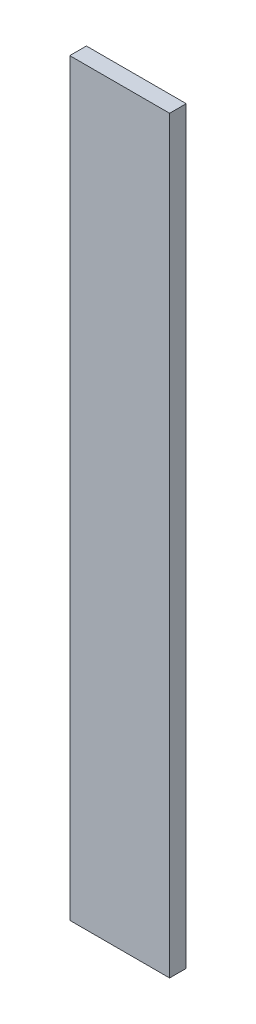
ISO-10303-21;
HEADER;
FILE_DESCRIPTION(('STEP AP214'),'2;1');
FILE_NAME('part.step','',(''),(''),'','','');
FILE_SCHEMA(('AUTOMOTIVE_DESIGN { 1 0 10303 214 1 1 1 1 }'));
ENDSEC;
DATA;
#1=APPLICATION_CONTEXT('core data for automotive mechanical design processes');
#2=APPLICATION_PROTOCOL_DEFINITION('international standard','automotive_design',2000,#1);
#3=PRODUCT_CONTEXT('',#1,'mechanical');
#4=PRODUCT('Part','Part','',(#3));
#5=PRODUCT_RELATED_PRODUCT_CATEGORY('part','',(#4));
#6=PRODUCT_DEFINITION_FORMATION('','',#4);
#7=PRODUCT_DEFINITION_CONTEXT('part definition',#1,'design');
#8=PRODUCT_DEFINITION('design','',#6,#7);
#9=PRODUCT_DEFINITION_SHAPE('','',#8);
#10=(LENGTH_UNIT() NAMED_UNIT(*) SI_UNIT(.MILLI.,.METRE.));
#11=(NAMED_UNIT(*) PLANE_ANGLE_UNIT() SI_UNIT($,.RADIAN.));
#12=(NAMED_UNIT(*) SI_UNIT($,.STERADIAN.) SOLID_ANGLE_UNIT());
#13=UNCERTAINTY_MEASURE_WITH_UNIT(LENGTH_MEASURE(1.E-05),#10,'distance_accuracy_value','');
#14=(GEOMETRIC_REPRESENTATION_CONTEXT(3) GLOBAL_UNCERTAINTY_ASSIGNED_CONTEXT((#13)) GLOBAL_UNIT_ASSIGNED_CONTEXT((#10,
#11,#12)) REPRESENTATION_CONTEXT('',''));
#15=CARTESIAN_POINT('',(0.,0.,0.));
#16=DIRECTION('',(0.,0.,1.));
#17=DIRECTION('',(1.,0.,0.));
#18=AXIS2_PLACEMENT_3D('',#15,#16,#17);
#19=CARTESIAN_POINT('',(-0.0762,0.5715,0.0254));
#20=DIRECTION('',(0.,0.,1.));
#21=DIRECTION('',(1.,0.,0.));
#22=AXIS2_PLACEMENT_3D('',#19,#20,#21);
#23=PLANE('',#22);
#24=DIRECTION('',(0.,1.,0.));
#25=VECTOR('',#24,1.);
#26=CARTESIAN_POINT('',(0.0762,0.5715,0.0254));
#27=LINE('',#26,#25);
#28=CARTESIAN_POINT('',(0.0762,0.5715,0.0254));
#29=VERTEX_POINT('',#28);
#30=CARTESIAN_POINT('',(0.0762,-0.5715,0.0254));
#31=VERTEX_POINT('',#30);
#32=EDGE_CURVE('E53',#29,#31,#27,.F.);
#33=ORIENTED_EDGE('',*,*,#32,.F.);
#34=DIRECTION('',(1.,0.,0.));
#35=VECTOR('',#34,1.);
#36=CARTESIAN_POINT('',(-0.0762,0.5715,0.0254));
#37=LINE('',#36,#35);
#38=CARTESIAN_POINT('',(-0.0762,0.5715,0.0254));
#39=VERTEX_POINT('',#38);
#40=EDGE_CURVE('E68',#39,#29,#37,.T.);
#41=ORIENTED_EDGE('',*,*,#40,.F.);
#42=DIRECTION('',(0.,1.,0.));
#43=VECTOR('',#42,1.);
#44=CARTESIAN_POINT('',(-0.0762,-0.5715,0.0254));
#45=LINE('',#44,#43);
#46=CARTESIAN_POINT('',(-0.0762,-0.5715,0.0254));
#47=VERTEX_POINT('',#46);
#48=EDGE_CURVE('E20',#47,#39,#45,.T.);
#49=ORIENTED_EDGE('',*,*,#48,.F.);
#50=DIRECTION('',(1.,0.,0.));
#51=VECTOR('',#50,1.);
#52=CARTESIAN_POINT('',(0.0762,-0.5715,0.0254));
#53=LINE('',#52,#51);
#54=EDGE_CURVE('E58',#31,#47,#53,.F.);
#55=ORIENTED_EDGE('',*,*,#54,.F.);
#56=EDGE_LOOP('',(#33,#41,#49,#55));
#57=FACE_BOUND('',#56,.T.);
#58=ADVANCED_FACE('F17',(#57),#23,.T.);
#59=CARTESIAN_POINT('',(-0.0762,-0.5715,0.));
#60=DIRECTION('',(-1.,0.,0.));
#61=DIRECTION('',(0.,0.,1.));
#62=AXIS2_PLACEMENT_3D('',#59,#60,#61);
#63=PLANE('',#62);
#64=DIRECTION('',(0.,0.,1.));
#65=VECTOR('',#64,1.);
#66=CARTESIAN_POINT('',(-0.0762,0.5715,0.));
#67=LINE('',#66,#65);
#68=CARTESIAN_POINT('',(-0.0762,0.5715,0.));
#69=VERTEX_POINT('',#68);
#70=EDGE_CURVE('E79',#69,#39,#67,.T.);
#71=ORIENTED_EDGE('',*,*,#70,.F.);
#72=DIRECTION('',(0.,1.,0.));
#73=VECTOR('',#72,1.);
#74=CARTESIAN_POINT('',(-0.0762,0.5715,0.));
#75=LINE('',#74,#73);
#76=CARTESIAN_POINT('',(-0.0762,-0.5715,0.));
#77=VERTEX_POINT('',#76);
#78=EDGE_CURVE('E74',#69,#77,#75,.F.);
#79=ORIENTED_EDGE('',*,*,#78,.T.);
#80=DIRECTION('',(0.,0.,-1.));
#81=VECTOR('',#80,1.);
#82=CARTESIAN_POINT('',(-0.0762,-0.5715,0.));
#83=LINE('',#82,#81);
#84=EDGE_CURVE('E63',#47,#77,#83,.T.);
#85=ORIENTED_EDGE('',*,*,#84,.F.);
#86=ORIENTED_EDGE('',*,*,#48,.T.);
#87=EDGE_LOOP('',(#71,#79,#85,#86));
#88=FACE_BOUND('',#87,.T.);
#89=ADVANCED_FACE('F73',(#88),#63,.T.);
#90=CARTESIAN_POINT('',(0.0762,-0.5715,0.));
#91=DIRECTION('',(0.,-1.,0.));
#92=DIRECTION('',(0.,0.,-1.));
#93=AXIS2_PLACEMENT_3D('',#90,#91,#92);
#94=PLANE('',#93);
#95=ORIENTED_EDGE('',*,*,#84,.T.);
#96=DIRECTION('',(1.,0.,0.));
#97=VECTOR('',#96,1.);
#98=CARTESIAN_POINT('',(-0.0762,-0.5715,0.));
#99=LINE('',#98,#97);
#100=CARTESIAN_POINT('',(0.0762,-0.5715,0.));
#101=VERTEX_POINT('',#100);
#102=EDGE_CURVE('E84',#77,#101,#99,.T.);
#103=ORIENTED_EDGE('',*,*,#102,.T.);
#104=DIRECTION('',(0.,0.,-1.));
#105=VECTOR('',#104,1.);
#106=CARTESIAN_POINT('',(0.0762,-0.5715,0.));
#107=LINE('',#106,#105);
#108=EDGE_CURVE('E65',#31,#101,#107,.T.);
#109=ORIENTED_EDGE('',*,*,#108,.F.);
#110=ORIENTED_EDGE('',*,*,#54,.T.);
#111=EDGE_LOOP('',(#95,#103,#109,#110));
#112=FACE_BOUND('',#111,.T.);
#113=ADVANCED_FACE('F60',(#112),#94,.T.);
#114=CARTESIAN_POINT('',(0.0762,0.5715,0.));
#115=DIRECTION('',(1.,0.,0.));
#116=DIRECTION('',(0.,0.,-1.));
#117=AXIS2_PLACEMENT_3D('',#114,#115,#116);
#118=PLANE('',#117);
#119=ORIENTED_EDGE('',*,*,#108,.T.);
#120=DIRECTION('',(0.,1.,0.));
#121=VECTOR('',#120,1.);
#122=CARTESIAN_POINT('',(0.0762,0.5715,0.));
#123=LINE('',#122,#121);
#124=CARTESIAN_POINT('',(0.0762,0.5715,0.));
#125=VERTEX_POINT('',#124);
#126=EDGE_CURVE('E26',#101,#125,#123,.T.);
#127=ORIENTED_EDGE('',*,*,#126,.T.);
#128=DIRECTION('',(0.,0.,1.));
#129=VECTOR('',#128,1.);
#130=CARTESIAN_POINT('',(0.0762,0.5715,0.));
#131=LINE('',#130,#129);
#132=EDGE_CURVE('E34',#29,#125,#131,.F.);
#133=ORIENTED_EDGE('',*,*,#132,.F.);
#134=ORIENTED_EDGE('',*,*,#32,.T.);
#135=EDGE_LOOP('',(#119,#127,#133,#134));
#136=FACE_BOUND('',#135,.T.);
#137=ADVANCED_FACE('F88',(#136),#118,.T.);
#138=CARTESIAN_POINT('',(-0.0762,0.5715,0.));
#139=DIRECTION('',(0.,1.,0.));
#140=DIRECTION('',(0.,0.,1.));
#141=AXIS2_PLACEMENT_3D('',#138,#139,#140);
#142=PLANE('',#141);
#143=ORIENTED_EDGE('',*,*,#132,.T.);
#144=DIRECTION('',(1.,0.,0.));
#145=VECTOR('',#144,1.);
#146=CARTESIAN_POINT('',(-0.0762,0.5715,0.));
#147=LINE('',#146,#145);
#148=EDGE_CURVE('E11',#125,#69,#147,.F.);
#149=ORIENTED_EDGE('',*,*,#148,.T.);
#150=ORIENTED_EDGE('',*,*,#70,.T.);
#151=ORIENTED_EDGE('',*,*,#40,.T.);
#152=EDGE_LOOP('',(#143,#149,#150,#151));
#153=FACE_BOUND('',#152,.T.);
#154=ADVANCED_FACE('F91',(#153),#142,.T.);
#155=CARTESIAN_POINT('',(-0.0762,0.5715,0.));
#156=DIRECTION('',(0.,0.,1.));
#157=DIRECTION('',(1.,0.,0.));
#158=AXIS2_PLACEMENT_3D('',#155,#156,#157);
#159=PLANE('',#158);
#160=ORIENTED_EDGE('',*,*,#126,.F.);
#161=ORIENTED_EDGE('',*,*,#102,.F.);
#162=ORIENTED_EDGE('',*,*,#78,.F.);
#163=ORIENTED_EDGE('',*,*,#148,.F.);
#164=EDGE_LOOP('',(#160,#161,#162,#163));
#165=FACE_BOUND('',#164,.T.);
#166=ADVANCED_FACE('F90',(#165),#159,.F.);
#167=CLOSED_SHELL('',(#58,#89,#113,#137,#154,#166));
#168=MANIFOLD_SOLID_BREP('B1',#167);
#169=ADVANCED_BREP_SHAPE_REPRESENTATION('',(#18,#168),#14);
#170=SHAPE_DEFINITION_REPRESENTATION(#9,#169);
ENDSEC;
END-ISO-10303-21;
